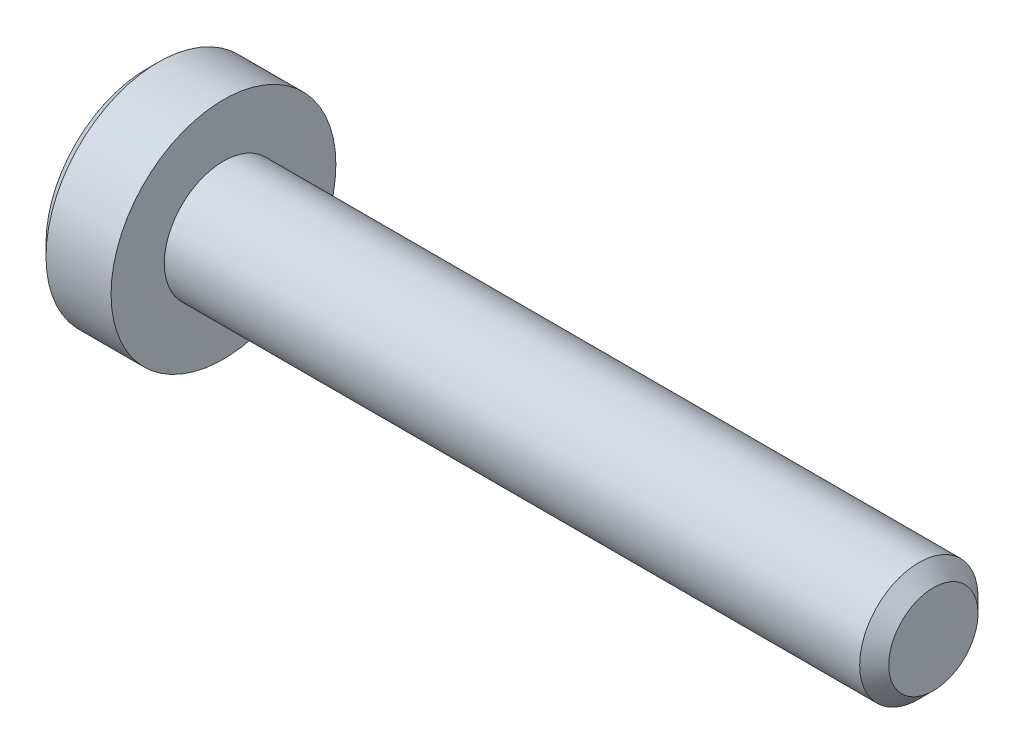
ISO-10303-21;
HEADER;
FILE_DESCRIPTION(('STEP AP214'),'2;1');
FILE_NAME('part.step','',(''),(''),'','','');
FILE_SCHEMA(('AUTOMOTIVE_DESIGN { 1 0 10303 214 1 1 1 1 }'));
ENDSEC;
DATA;
#1=APPLICATION_CONTEXT('core data for automotive mechanical design processes');
#2=APPLICATION_PROTOCOL_DEFINITION('international standard','automotive_design',2000,#1);
#3=PRODUCT_CONTEXT('',#1,'mechanical');
#4=PRODUCT('Part','Part','',(#3));
#5=PRODUCT_RELATED_PRODUCT_CATEGORY('part','',(#4));
#6=PRODUCT_DEFINITION_FORMATION('','',#4);
#7=PRODUCT_DEFINITION_CONTEXT('part definition',#1,'design');
#8=PRODUCT_DEFINITION('design','',#6,#7);
#9=PRODUCT_DEFINITION_SHAPE('','',#8);
#10=(LENGTH_UNIT() NAMED_UNIT(*) SI_UNIT(.MILLI.,.METRE.));
#11=(NAMED_UNIT(*) PLANE_ANGLE_UNIT() SI_UNIT($,.RADIAN.));
#12=(NAMED_UNIT(*) SI_UNIT($,.STERADIAN.) SOLID_ANGLE_UNIT());
#13=UNCERTAINTY_MEASURE_WITH_UNIT(LENGTH_MEASURE(1.E-05),#10,'distance_accuracy_value','');
#14=(GEOMETRIC_REPRESENTATION_CONTEXT(3) GLOBAL_UNCERTAINTY_ASSIGNED_CONTEXT((#13)) GLOBAL_UNIT_ASSIGNED_CONTEXT((#10,
#11,#12)) REPRESENTATION_CONTEXT('',''));
#15=CARTESIAN_POINT('',(0.,0.,0.));
#16=DIRECTION('',(0.,0.,1.));
#17=DIRECTION('',(1.,0.,0.));
#18=AXIS2_PLACEMENT_3D('',#15,#16,#17);
#19=CARTESIAN_POINT('',(-1.3,0.,0.));
#20=DIRECTION('',(1.,0.,0.));
#21=DIRECTION('',(0.,0.,-1.));
#22=AXIS2_PLACEMENT_3D('',#19,#20,#21);
#23=PLANE('',#22);
#24=CARTESIAN_POINT('',(-1.3,0.,0.));
#25=DIRECTION('',(-1.,0.,0.));
#26=DIRECTION('',(0.,0.,1.));
#27=AXIS2_PLACEMENT_3D('',#24,#25,#26);
#28=CIRCLE('',#27,1.7);
#29=CARTESIAN_POINT('',(-1.3,0.,1.7));
#30=VERTEX_POINT('',#29);
#31=EDGE_CURVE('E11',#30,#30,#28,.T.);
#32=ORIENTED_EDGE('',*,*,#31,.T.);
#33=EDGE_LOOP('',(#32));
#34=FACE_BOUND('',#33,.T.);
#35=DIRECTION('',(0.,-1.,0.));
#36=VECTOR('',#35,1.);
#37=CARTESIAN_POINT('',(-1.3,0.37527767497326,0.65));
#38=LINE('',#37,#36);
#39=CARTESIAN_POINT('',(-1.3,0.37527767497326,0.65));
#40=VERTEX_POINT('',#39);
#41=CARTESIAN_POINT('',(-1.3,-0.37527767497326,0.65));
#42=VERTEX_POINT('',#41);
#43=EDGE_CURVE('E51',#40,#42,#38,.T.);
#44=ORIENTED_EDGE('',*,*,#43,.T.);
#45=DIRECTION('',(0.,-0.499999999999993,-0.866025403784442));
#46=VECTOR('',#45,1.);
#47=CARTESIAN_POINT('',(-1.3,-0.37527767497326,0.65));
#48=LINE('',#47,#46);
#49=CARTESIAN_POINT('',(-1.3,-0.75055534994651,0.));
#50=VERTEX_POINT('',#49);
#51=EDGE_CURVE('E122',#42,#50,#48,.T.);
#52=ORIENTED_EDGE('',*,*,#51,.T.);
#53=DIRECTION('',(0.,0.499999999999993,-0.866025403784442));
#54=VECTOR('',#53,1.);
#55=CARTESIAN_POINT('',(-1.3,-0.75055534994651,0.));
#56=LINE('',#55,#54);
#57=CARTESIAN_POINT('',(-1.3,-0.37527767497326,-0.65));
#58=VERTEX_POINT('',#57);
#59=EDGE_CURVE('E125',#50,#58,#56,.T.);
#60=ORIENTED_EDGE('',*,*,#59,.T.);
#61=DIRECTION('',(0.,1.,0.));
#62=VECTOR('',#61,1.);
#63=CARTESIAN_POINT('',(-1.3,-0.37527767497326,-0.65));
#64=LINE('',#63,#62);
#65=CARTESIAN_POINT('',(-1.3,0.37527767497326,-0.65));
#66=VERTEX_POINT('',#65);
#67=EDGE_CURVE('E128',#58,#66,#64,.T.);
#68=ORIENTED_EDGE('',*,*,#67,.T.);
#69=DIRECTION('',(0.,0.499999999999993,0.866025403784442));
#70=VECTOR('',#69,1.);
#71=CARTESIAN_POINT('',(-1.3,0.37527767497326,-0.65));
#72=LINE('',#71,#70);
#73=CARTESIAN_POINT('',(-1.3,0.75055534994651,0.));
#74=VERTEX_POINT('',#73);
#75=EDGE_CURVE('E112',#66,#74,#72,.T.);
#76=ORIENTED_EDGE('',*,*,#75,.T.);
#77=DIRECTION('',(0.,-0.499999999999993,0.866025403784442));
#78=VECTOR('',#77,1.);
#79=CARTESIAN_POINT('',(-1.3,0.75055534994651,0.));
#80=LINE('',#79,#78);
#81=EDGE_CURVE('E131',#74,#40,#80,.T.);
#82=ORIENTED_EDGE('',*,*,#81,.T.);
#83=EDGE_LOOP('',(#44,#52,#60,#68,#76,#82));
#84=FACE_BOUND('',#83,.T.);
#85=ADVANCED_FACE('F37',(#34,#84),#23,.F.);
#86=CARTESIAN_POINT('',(-1.1,0.,0.));
#87=DIRECTION('',(1.,0.,0.));
#88=DIRECTION('',(0.,0.,-1.));
#89=AXIS2_PLACEMENT_3D('',#86,#87,#88);
#90=CONICAL_SURFACE('',#89,1.9,0.785398163397452);
#91=ORIENTED_EDGE('',*,*,#31,.F.);
#92=EDGE_LOOP('',(#91));
#93=FACE_BOUND('',#92,.T.);
#94=CARTESIAN_POINT('',(-1.1,0.,0.));
#95=DIRECTION('',(-1.,0.,0.));
#96=DIRECTION('',(0.,0.,1.));
#97=AXIS2_PLACEMENT_3D('',#94,#95,#96);
#98=CIRCLE('',#97,1.9);
#99=CARTESIAN_POINT('',(-1.1,0.,1.9));
#100=VERTEX_POINT('',#99);
#101=EDGE_CURVE('E44',#100,#100,#98,.T.);
#102=ORIENTED_EDGE('',*,*,#101,.T.);
#103=EDGE_LOOP('',(#102));
#104=FACE_BOUND('',#103,.T.);
#105=ADVANCED_FACE('F156',(#93,#104),#90,.T.);
#106=CARTESIAN_POINT('',(12.,0.,0.));
#107=DIRECTION('',(-1.,0.,0.));
#108=DIRECTION('',(0.,0.,1.));
#109=AXIS2_PLACEMENT_3D('',#106,#107,#108);
#110=CYLINDRICAL_SURFACE('',#109,1.9);
#111=ORIENTED_EDGE('',*,*,#101,.F.);
#112=EDGE_LOOP('',(#111));
#113=FACE_BOUND('',#112,.T.);
#114=CARTESIAN_POINT('',(0.,0.,0.));
#115=DIRECTION('',(-1.,0.,0.));
#116=DIRECTION('',(0.,0.,1.));
#117=AXIS2_PLACEMENT_3D('',#114,#115,#116);
#118=CIRCLE('',#117,1.9);
#119=CARTESIAN_POINT('',(0.,0.,1.9));
#120=VERTEX_POINT('',#119);
#121=EDGE_CURVE('E151',#120,#120,#118,.T.);
#122=ORIENTED_EDGE('',*,*,#121,.T.);
#123=EDGE_LOOP('',(#122));
#124=FACE_BOUND('',#123,.T.);
#125=ADVANCED_FACE('F158',(#113,#124),#110,.T.);
#126=CARTESIAN_POINT('',(0.,1.9,0.));
#127=DIRECTION('',(-1.,0.,0.));
#128=DIRECTION('',(0.,0.,1.));
#129=AXIS2_PLACEMENT_3D('',#126,#127,#128);
#130=PLANE('',#129);
#131=ORIENTED_EDGE('',*,*,#121,.F.);
#132=EDGE_LOOP('',(#131));
#133=FACE_BOUND('',#132,.T.);
#134=CARTESIAN_POINT('',(0.,0.,0.));
#135=DIRECTION('',(-1.,0.,0.));
#136=DIRECTION('',(0.,0.,1.));
#137=AXIS2_PLACEMENT_3D('',#134,#135,#136);
#138=CIRCLE('',#137,1.);
#139=CARTESIAN_POINT('',(0.,0.,1.));
#140=VERTEX_POINT('',#139);
#141=EDGE_CURVE('E148',#140,#140,#138,.T.);
#142=ORIENTED_EDGE('',*,*,#141,.T.);
#143=EDGE_LOOP('',(#142));
#144=FACE_BOUND('',#143,.T.);
#145=ADVANCED_FACE('F161',(#133,#144),#130,.F.);
#146=CARTESIAN_POINT('',(12.,0.,0.));
#147=DIRECTION('',(-1.,0.,0.));
#148=DIRECTION('',(0.,0.,1.));
#149=AXIS2_PLACEMENT_3D('',#146,#147,#148);
#150=CYLINDRICAL_SURFACE('',#149,1.);
#151=ORIENTED_EDGE('',*,*,#141,.F.);
#152=EDGE_LOOP('',(#151));
#153=FACE_BOUND('',#152,.T.);
#154=CARTESIAN_POINT('',(11.7545,0.,0.));
#155=DIRECTION('',(-1.,0.,0.));
#156=DIRECTION('',(0.,0.,1.));
#157=AXIS2_PLACEMENT_3D('',#154,#155,#156);
#158=CIRCLE('',#157,1.);
#159=CARTESIAN_POINT('',(11.7545,0.,1.));
#160=VERTEX_POINT('',#159);
#161=EDGE_CURVE('E145',#160,#160,#158,.T.);
#162=ORIENTED_EDGE('',*,*,#161,.T.);
#163=EDGE_LOOP('',(#162));
#164=FACE_BOUND('',#163,.T.);
#165=ADVANCED_FACE('F167',(#153,#164),#150,.T.);
#166=CARTESIAN_POINT('',(12.,0.,0.));
#167=DIRECTION('',(-1.,0.,0.));
#168=DIRECTION('',(0.,0.,1.));
#169=AXIS2_PLACEMENT_3D('',#166,#167,#168);
#170=CONICAL_SURFACE('',#169,0.754499999999999,0.785398163397448);
#171=ORIENTED_EDGE('',*,*,#161,.F.);
#172=EDGE_LOOP('',(#171));
#173=FACE_BOUND('',#172,.T.);
#174=CARTESIAN_POINT('',(12.,0.,0.));
#175=DIRECTION('',(-1.,0.,0.));
#176=DIRECTION('',(0.,0.,1.));
#177=AXIS2_PLACEMENT_3D('',#174,#175,#176);
#178=CIRCLE('',#177,0.754499999999999);
#179=CARTESIAN_POINT('',(12.,0.,0.754499999999999));
#180=VERTEX_POINT('',#179);
#181=EDGE_CURVE('E142',#180,#180,#178,.T.);
#182=ORIENTED_EDGE('',*,*,#181,.T.);
#183=EDGE_LOOP('',(#182));
#184=FACE_BOUND('',#183,.T.);
#185=ADVANCED_FACE('F173',(#173,#184),#170,.T.);
#186=CARTESIAN_POINT('',(12.,0.754499999999999,0.));
#187=DIRECTION('',(-1.,0.,0.));
#188=DIRECTION('',(0.,0.,1.));
#189=AXIS2_PLACEMENT_3D('',#186,#187,#188);
#190=PLANE('',#189);
#191=ORIENTED_EDGE('',*,*,#181,.F.);
#192=EDGE_LOOP('',(#191));
#193=FACE_BOUND('',#192,.T.);
#194=ADVANCED_FACE('F179',(#193),#190,.F.);
#195=CARTESIAN_POINT('',(-0.6,0.37527767497326,0.65));
#196=DIRECTION('',(0.,0.,-1.));
#197=DIRECTION('',(-1.,0.,0.));
#198=AXIS2_PLACEMENT_3D('',#195,#196,#197);
#199=PLANE('',#198);
#200=ORIENTED_EDGE('',*,*,#43,.F.);
#201=DIRECTION('',(-1.,0.,0.));
#202=VECTOR('',#201,1.);
#203=CARTESIAN_POINT('',(-0.6,0.37527767497326,0.65));
#204=LINE('',#203,#202);
#205=CARTESIAN_POINT('',(-0.6,0.37527767497326,0.65));
#206=VERTEX_POINT('',#205);
#207=EDGE_CURVE('E117',#206,#40,#204,.T.);
#208=ORIENTED_EDGE('',*,*,#207,.F.);
#209=DIRECTION('',(0.,-1.,0.));
#210=VECTOR('',#209,1.);
#211=CARTESIAN_POINT('',(-0.6,0.37527767497326,0.65));
#212=LINE('',#211,#210);
#213=CARTESIAN_POINT('',(-0.6,-0.37527767497326,0.65));
#214=VERTEX_POINT('',#213);
#215=EDGE_CURVE('E134',#206,#214,#212,.T.);
#216=ORIENTED_EDGE('',*,*,#215,.T.);
#217=DIRECTION('',(-1.,0.,0.));
#218=VECTOR('',#217,1.);
#219=CARTESIAN_POINT('',(-0.6,-0.37527767497326,0.65));
#220=LINE('',#219,#218);
#221=EDGE_CURVE('E140',#214,#42,#220,.T.);
#222=ORIENTED_EDGE('',*,*,#221,.T.);
#223=EDGE_LOOP('',(#200,#208,#216,#222));
#224=FACE_BOUND('',#223,.T.);
#225=ADVANCED_FACE('F184',(#224),#199,.T.);
#226=CARTESIAN_POINT('',(-0.6,-0.37527767497326,0.65));
#227=DIRECTION('',(0.,0.866025403784442,-0.499999999999993));
#228=DIRECTION('',(0.,0.499999999999993,0.866025403784442));
#229=AXIS2_PLACEMENT_3D('',#226,#227,#228);
#230=PLANE('',#229);
#231=ORIENTED_EDGE('',*,*,#51,.F.);
#232=ORIENTED_EDGE('',*,*,#221,.F.);
#233=DIRECTION('',(0.,-0.499999999999993,-0.866025403784442));
#234=VECTOR('',#233,1.);
#235=CARTESIAN_POINT('',(-0.6,-0.37527767497326,0.65));
#236=LINE('',#235,#234);
#237=CARTESIAN_POINT('',(-0.6,-0.75055534994651,0.));
#238=VERTEX_POINT('',#237);
#239=EDGE_CURVE('E90',#214,#238,#236,.T.);
#240=ORIENTED_EDGE('',*,*,#239,.T.);
#241=DIRECTION('',(-1.,0.,0.));
#242=VECTOR('',#241,1.);
#243=CARTESIAN_POINT('',(-0.6,-0.75055534994651,0.));
#244=LINE('',#243,#242);
#245=EDGE_CURVE('E138',#238,#50,#244,.T.);
#246=ORIENTED_EDGE('',*,*,#245,.T.);
#247=EDGE_LOOP('',(#231,#232,#240,#246));
#248=FACE_BOUND('',#247,.T.);
#249=ADVANCED_FACE('F189',(#248),#230,.T.);
#250=CARTESIAN_POINT('',(-0.6,-0.75055534994651,0.));
#251=DIRECTION('',(0.,0.866025403784442,0.499999999999993));
#252=DIRECTION('',(0.,-0.499999999999993,0.866025403784442));
#253=AXIS2_PLACEMENT_3D('',#250,#251,#252);
#254=PLANE('',#253);
#255=ORIENTED_EDGE('',*,*,#59,.F.);
#256=ORIENTED_EDGE('',*,*,#245,.F.);
#257=DIRECTION('',(0.,0.499999999999993,-0.866025403784442));
#258=VECTOR('',#257,1.);
#259=CARTESIAN_POINT('',(-0.6,-0.75055534994651,0.));
#260=LINE('',#259,#258);
#261=CARTESIAN_POINT('',(-0.6,-0.37527767497326,-0.65));
#262=VERTEX_POINT('',#261);
#263=EDGE_CURVE('E108',#238,#262,#260,.T.);
#264=ORIENTED_EDGE('',*,*,#263,.T.);
#265=DIRECTION('',(-1.,0.,0.));
#266=VECTOR('',#265,1.);
#267=CARTESIAN_POINT('',(-0.6,-0.37527767497326,-0.65));
#268=LINE('',#267,#266);
#269=EDGE_CURVE('E105',#262,#58,#268,.T.);
#270=ORIENTED_EDGE('',*,*,#269,.T.);
#271=EDGE_LOOP('',(#255,#256,#264,#270));
#272=FACE_BOUND('',#271,.T.);
#273=ADVANCED_FACE('F206',(#272),#254,.T.);
#274=CARTESIAN_POINT('',(-0.6,-0.37527767497326,-0.65));
#275=DIRECTION('',(0.,0.,1.));
#276=DIRECTION('',(1.,0.,0.));
#277=AXIS2_PLACEMENT_3D('',#274,#275,#276);
#278=PLANE('',#277);
#279=ORIENTED_EDGE('',*,*,#67,.F.);
#280=ORIENTED_EDGE('',*,*,#269,.F.);
#281=DIRECTION('',(0.,1.,0.));
#282=VECTOR('',#281,1.);
#283=CARTESIAN_POINT('',(-0.6,-0.37527767497326,-0.65));
#284=LINE('',#283,#282);
#285=CARTESIAN_POINT('',(-0.6,0.37527767497326,-0.65));
#286=VERTEX_POINT('',#285);
#287=EDGE_CURVE('E100',#262,#286,#284,.T.);
#288=ORIENTED_EDGE('',*,*,#287,.T.);
#289=DIRECTION('',(-1.,0.,0.));
#290=VECTOR('',#289,1.);
#291=CARTESIAN_POINT('',(-0.6,0.37527767497326,-0.65));
#292=LINE('',#291,#290);
#293=EDGE_CURVE('E104',#286,#66,#292,.T.);
#294=ORIENTED_EDGE('',*,*,#293,.T.);
#295=EDGE_LOOP('',(#279,#280,#288,#294));
#296=FACE_BOUND('',#295,.T.);
#297=ADVANCED_FACE('F103',(#296),#278,.T.);
#298=CARTESIAN_POINT('',(-0.6,0.37527767497326,-0.65));
#299=DIRECTION('',(0.,-0.866025403784442,0.499999999999993));
#300=DIRECTION('',(0.,-0.499999999999993,-0.866025403784442));
#301=AXIS2_PLACEMENT_3D('',#298,#299,#300);
#302=PLANE('',#301);
#303=ORIENTED_EDGE('',*,*,#75,.F.);
#304=ORIENTED_EDGE('',*,*,#293,.F.);
#305=DIRECTION('',(0.,0.499999999999993,0.866025403784442));
#306=VECTOR('',#305,1.);
#307=CARTESIAN_POINT('',(-0.6,0.37527767497326,-0.65));
#308=LINE('',#307,#306);
#309=CARTESIAN_POINT('',(-0.6,0.75055534994651,0.));
#310=VERTEX_POINT('',#309);
#311=EDGE_CURVE('E107',#286,#310,#308,.T.);
#312=ORIENTED_EDGE('',*,*,#311,.T.);
#313=DIRECTION('',(-1.,0.,0.));
#314=VECTOR('',#313,1.);
#315=CARTESIAN_POINT('',(-0.6,0.75055534994651,0.));
#316=LINE('',#315,#314);
#317=EDGE_CURVE('E81',#310,#74,#316,.T.);
#318=ORIENTED_EDGE('',*,*,#317,.T.);
#319=EDGE_LOOP('',(#303,#304,#312,#318));
#320=FACE_BOUND('',#319,.T.);
#321=ADVANCED_FACE('F110',(#320),#302,.T.);
#322=CARTESIAN_POINT('',(-0.6,0.75055534994651,0.));
#323=DIRECTION('',(0.,-0.866025403784442,-0.499999999999993));
#324=DIRECTION('',(0.,0.499999999999993,-0.866025403784442));
#325=AXIS2_PLACEMENT_3D('',#322,#323,#324);
#326=PLANE('',#325);
#327=ORIENTED_EDGE('',*,*,#81,.F.);
#328=ORIENTED_EDGE('',*,*,#317,.F.);
#329=DIRECTION('',(0.,-0.499999999999993,0.866025403784442));
#330=VECTOR('',#329,1.);
#331=CARTESIAN_POINT('',(-0.6,0.75055534994651,0.));
#332=LINE('',#331,#330);
#333=EDGE_CURVE('E59',#310,#206,#332,.T.);
#334=ORIENTED_EDGE('',*,*,#333,.T.);
#335=ORIENTED_EDGE('',*,*,#207,.T.);
#336=EDGE_LOOP('',(#327,#328,#334,#335));
#337=FACE_BOUND('',#336,.T.);
#338=ADVANCED_FACE('F199',(#337),#326,.T.);
#339=CARTESIAN_POINT('',(-0.6,0.,0.));
#340=DIRECTION('',(1.,0.,0.));
#341=DIRECTION('',(0.,0.,-1.));
#342=AXIS2_PLACEMENT_3D('',#339,#340,#341);
#343=PLANE('',#342);
#344=ORIENTED_EDGE('',*,*,#215,.F.);
#345=ORIENTED_EDGE('',*,*,#333,.F.);
#346=ORIENTED_EDGE('',*,*,#311,.F.);
#347=ORIENTED_EDGE('',*,*,#287,.F.);
#348=ORIENTED_EDGE('',*,*,#263,.F.);
#349=ORIENTED_EDGE('',*,*,#239,.F.);
#350=EDGE_LOOP('',(#344,#345,#346,#347,#348,#349));
#351=FACE_BOUND('',#350,.T.);
#352=ADVANCED_FACE('F115',(#351),#343,.F.);
#353=CLOSED_SHELL('',(#85,#105,#125,#145,#165,#185,#194,#225,#249,#273,#297,#321,#338,#352));
#354=MANIFOLD_SOLID_BREP('B2',#353);
#355=ADVANCED_BREP_SHAPE_REPRESENTATION('',(#18,#354),#14);
#356=SHAPE_DEFINITION_REPRESENTATION(#9,#355);
ENDSEC;
END-ISO-10303-21;
